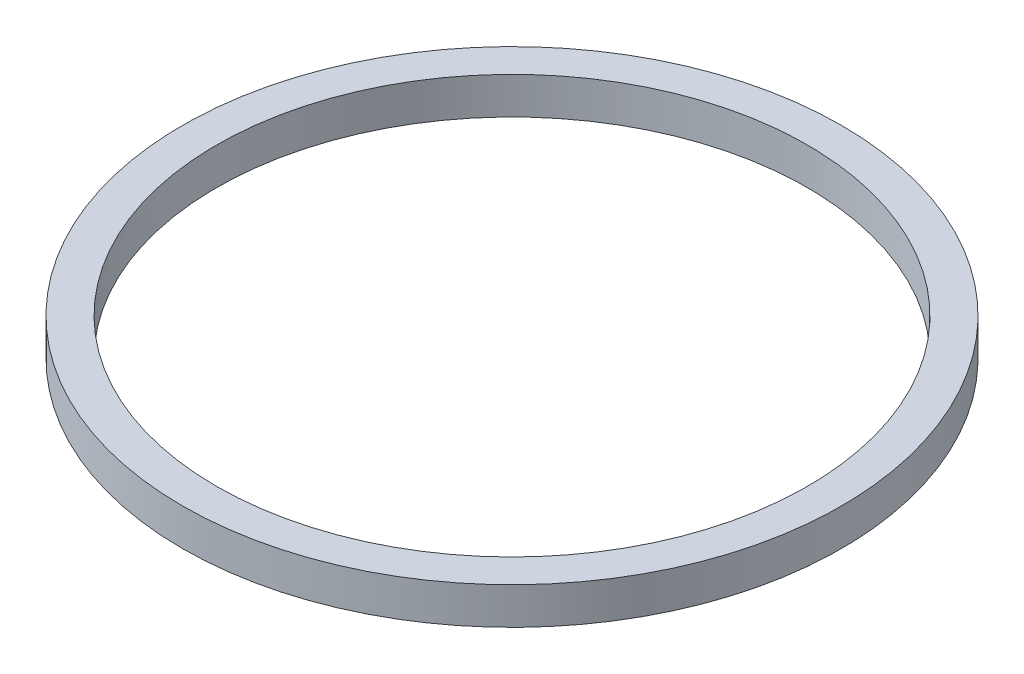
ISO-10303-21;
HEADER;
FILE_DESCRIPTION(('STEP AP214'),'2;1');
FILE_NAME('part.step','',(''),(''),'','','');
FILE_SCHEMA(('AUTOMOTIVE_DESIGN { 1 0 10303 214 1 1 1 1 }'));
ENDSEC;
DATA;
#1=APPLICATION_CONTEXT('core data for automotive mechanical design processes');
#2=APPLICATION_PROTOCOL_DEFINITION('international standard','automotive_design',2000,#1);
#3=PRODUCT_CONTEXT('',#1,'mechanical');
#4=PRODUCT('Part','Part','',(#3));
#5=PRODUCT_RELATED_PRODUCT_CATEGORY('part','',(#4));
#6=PRODUCT_DEFINITION_FORMATION('','',#4);
#7=PRODUCT_DEFINITION_CONTEXT('part definition',#1,'design');
#8=PRODUCT_DEFINITION('design','',#6,#7);
#9=PRODUCT_DEFINITION_SHAPE('','',#8);
#10=(LENGTH_UNIT() NAMED_UNIT(*) SI_UNIT(.MILLI.,.METRE.));
#11=(NAMED_UNIT(*) PLANE_ANGLE_UNIT() SI_UNIT($,.RADIAN.));
#12=(NAMED_UNIT(*) SI_UNIT($,.STERADIAN.) SOLID_ANGLE_UNIT());
#13=UNCERTAINTY_MEASURE_WITH_UNIT(LENGTH_MEASURE(1.E-05),#10,'distance_accuracy_value','');
#14=(GEOMETRIC_REPRESENTATION_CONTEXT(3) GLOBAL_UNCERTAINTY_ASSIGNED_CONTEXT((#13)) GLOBAL_UNIT_ASSIGNED_CONTEXT((#10,
#11,#12)) REPRESENTATION_CONTEXT('',''));
#15=CARTESIAN_POINT('',(0.,0.,0.));
#16=DIRECTION('',(0.,0.,1.));
#17=DIRECTION('',(1.,0.,0.));
#18=AXIS2_PLACEMENT_3D('',#15,#16,#17);
#19=CARTESIAN_POINT('',(0.,1.5875,0.));
#20=DIRECTION('',(0.,1.,0.));
#21=DIRECTION('',(0.,0.,1.));
#22=AXIS2_PLACEMENT_3D('',#19,#20,#21);
#23=PLANE('',#22);
#24=CARTESIAN_POINT('',(0.,1.5875,0.));
#25=DIRECTION('',(0.,1.,0.));
#26=DIRECTION('',(0.,0.,1.));
#27=AXIS2_PLACEMENT_3D('',#24,#25,#26);
#28=CIRCLE('',#27,14.1605);
#29=CARTESIAN_POINT('',(0.,1.5875,14.1605));
#30=VERTEX_POINT('',#29);
#31=EDGE_CURVE('E10',#30,#30,#28,.T.);
#32=ORIENTED_EDGE('',*,*,#31,.T.);
#33=EDGE_LOOP('',(#32));
#34=FACE_BOUND('',#33,.T.);
#35=CARTESIAN_POINT('',(0.,1.5875,0.));
#36=DIRECTION('',(0.,1.,0.));
#37=DIRECTION('',(0.,0.,1.));
#38=AXIS2_PLACEMENT_3D('',#35,#36,#37);
#39=CIRCLE('',#38,12.7);
#40=CARTESIAN_POINT('',(0.,1.5875,12.7));
#41=VERTEX_POINT('',#40);
#42=EDGE_CURVE('E42',#41,#41,#39,.T.);
#43=ORIENTED_EDGE('',*,*,#42,.F.);
#44=EDGE_LOOP('',(#43));
#45=FACE_BOUND('',#44,.T.);
#46=ADVANCED_FACE('F31',(#34,#45),#23,.T.);
#47=CARTESIAN_POINT('',(0.,0.,0.));
#48=DIRECTION('',(0.,1.,0.));
#49=DIRECTION('',(0.,0.,1.));
#50=AXIS2_PLACEMENT_3D('',#47,#48,#49);
#51=PLANE('',#50);
#52=CARTESIAN_POINT('',(0.,0.,0.));
#53=DIRECTION('',(0.,1.,0.));
#54=DIRECTION('',(0.,0.,1.));
#55=AXIS2_PLACEMENT_3D('',#52,#53,#54);
#56=CIRCLE('',#55,14.1605);
#57=CARTESIAN_POINT('',(0.,0.,14.1605));
#58=VERTEX_POINT('',#57);
#59=EDGE_CURVE('E35',#58,#58,#56,.T.);
#60=ORIENTED_EDGE('',*,*,#59,.F.);
#61=EDGE_LOOP('',(#60));
#62=FACE_BOUND('',#61,.T.);
#63=CARTESIAN_POINT('',(0.,0.,0.));
#64=DIRECTION('',(0.,1.,0.));
#65=DIRECTION('',(0.,0.,1.));
#66=AXIS2_PLACEMENT_3D('',#63,#64,#65);
#67=CIRCLE('',#66,12.7);
#68=CARTESIAN_POINT('',(0.,0.,12.7));
#69=VERTEX_POINT('',#68);
#70=EDGE_CURVE('E44',#69,#69,#67,.T.);
#71=ORIENTED_EDGE('',*,*,#70,.T.);
#72=EDGE_LOOP('',(#71));
#73=FACE_BOUND('',#72,.T.);
#74=ADVANCED_FACE('F54',(#62,#73),#51,.F.);
#75=CARTESIAN_POINT('',(0.,1.5875,0.));
#76=DIRECTION('',(0.,-1.,0.));
#77=DIRECTION('',(0.,0.,-1.));
#78=AXIS2_PLACEMENT_3D('',#75,#76,#77);
#79=CYLINDRICAL_SURFACE('',#78,14.1605);
#80=ORIENTED_EDGE('',*,*,#31,.F.);
#81=EDGE_LOOP('',(#80));
#82=FACE_BOUND('',#81,.T.);
#83=ORIENTED_EDGE('',*,*,#59,.T.);
#84=EDGE_LOOP('',(#83));
#85=FACE_BOUND('',#84,.T.);
#86=ADVANCED_FACE('F33',(#82,#85),#79,.T.);
#87=CARTESIAN_POINT('',(0.,1.5875,0.));
#88=DIRECTION('',(0.,-1.,0.));
#89=DIRECTION('',(0.,0.,-1.));
#90=AXIS2_PLACEMENT_3D('',#87,#88,#89);
#91=CYLINDRICAL_SURFACE('',#90,12.7);
#92=ORIENTED_EDGE('',*,*,#42,.T.);
#93=EDGE_LOOP('',(#92));
#94=FACE_BOUND('',#93,.T.);
#95=ORIENTED_EDGE('',*,*,#70,.F.);
#96=EDGE_LOOP('',(#95));
#97=FACE_BOUND('',#96,.T.);
#98=ADVANCED_FACE('F50',(#94,#97),#91,.F.);
#99=CLOSED_SHELL('',(#46,#74,#86,#98));
#100=MANIFOLD_SOLID_BREP('B2',#99);
#101=ADVANCED_BREP_SHAPE_REPRESENTATION('',(#18,#100),#14);
#102=SHAPE_DEFINITION_REPRESENTATION(#9,#101);
ENDSEC;
END-ISO-10303-21;
